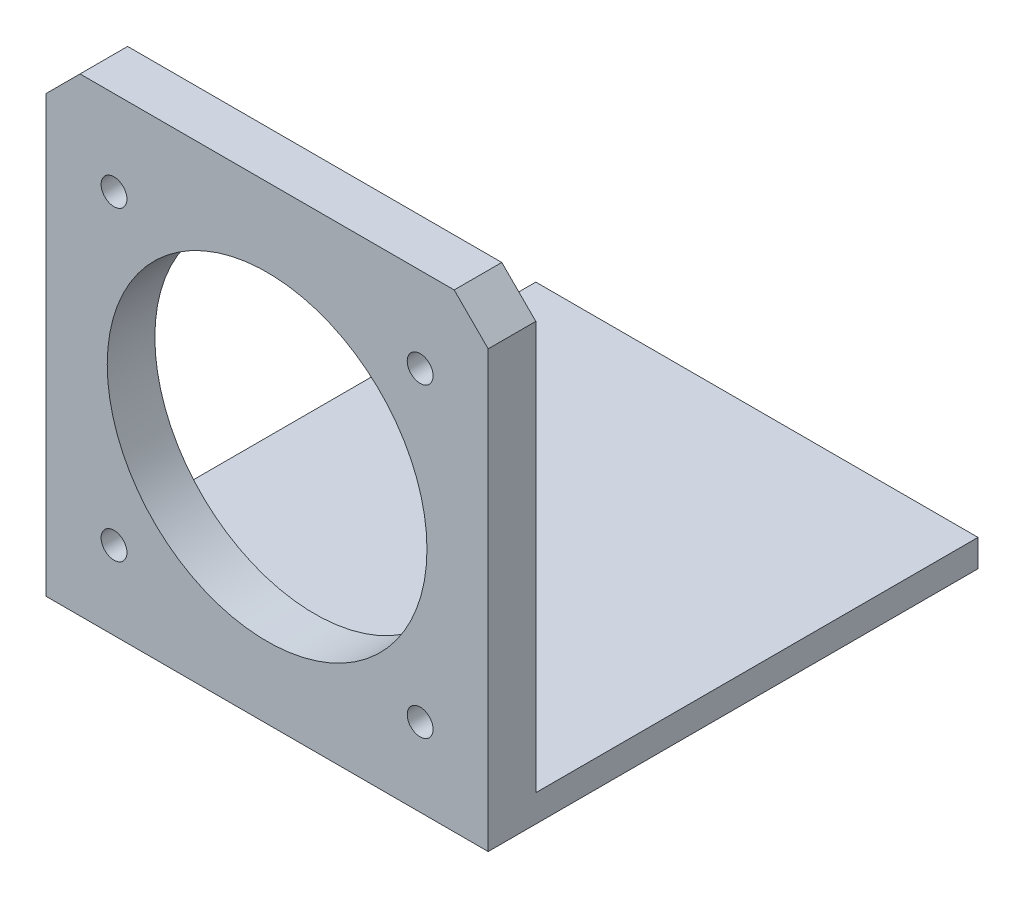
ISO-10303-21;
HEADER;
FILE_DESCRIPTION(('STEP AP214'),'2;1');
FILE_NAME('part.step','',(''),(''),'','','');
FILE_SCHEMA(('AUTOMOTIVE_DESIGN { 1 0 10303 214 1 1 1 1 }'));
ENDSEC;
DATA;
#1=APPLICATION_CONTEXT('core data for automotive mechanical design processes');
#2=APPLICATION_PROTOCOL_DEFINITION('international standard','automotive_design',2000,#1);
#3=PRODUCT_CONTEXT('',#1,'mechanical');
#4=PRODUCT('Part','Part','',(#3));
#5=PRODUCT_RELATED_PRODUCT_CATEGORY('part','',(#4));
#6=PRODUCT_DEFINITION_FORMATION('','',#4);
#7=PRODUCT_DEFINITION_CONTEXT('part definition',#1,'design');
#8=PRODUCT_DEFINITION('design','',#6,#7);
#9=PRODUCT_DEFINITION_SHAPE('','',#8);
#10=(LENGTH_UNIT() NAMED_UNIT(*) SI_UNIT(.MILLI.,.METRE.));
#11=(NAMED_UNIT(*) PLANE_ANGLE_UNIT() SI_UNIT($,.RADIAN.));
#12=(NAMED_UNIT(*) SI_UNIT($,.STERADIAN.) SOLID_ANGLE_UNIT());
#13=UNCERTAINTY_MEASURE_WITH_UNIT(LENGTH_MEASURE(1.E-05),#10,'distance_accuracy_value','');
#14=(GEOMETRIC_REPRESENTATION_CONTEXT(3) GLOBAL_UNCERTAINTY_ASSIGNED_CONTEXT((#13)) GLOBAL_UNIT_ASSIGNED_CONTEXT((#10,
#11,#12)) REPRESENTATION_CONTEXT('',''));
#15=CARTESIAN_POINT('',(0.,0.,0.));
#16=DIRECTION('',(0.,0.,1.));
#17=DIRECTION('',(1.,0.,0.));
#18=AXIS2_PLACEMENT_3D('',#15,#16,#17);
#19=CARTESIAN_POINT('',(65.,0.,0.));
#20=DIRECTION('',(0.,1.,0.));
#21=DIRECTION('',(0.,0.,1.));
#22=AXIS2_PLACEMENT_3D('',#19,#20,#21);
#23=PLANE('',#22);
#24=DIRECTION('',(0.,0.,-1.));
#25=VECTOR('',#24,1.);
#26=CARTESIAN_POINT('',(0.,0.,0.));
#27=LINE('',#26,#25);
#28=CARTESIAN_POINT('',(0.,0.,0.));
#29=VERTEX_POINT('',#28);
#30=CARTESIAN_POINT('',(0.,0.,-65.));
#31=VERTEX_POINT('',#30);
#32=EDGE_CURVE('E160',#29,#31,#27,.T.);
#33=ORIENTED_EDGE('',*,*,#32,.F.);
#34=DIRECTION('',(-1.,0.,0.));
#35=VECTOR('',#34,1.);
#36=CARTESIAN_POINT('',(65.,0.,0.));
#37=LINE('',#36,#35);
#38=CARTESIAN_POINT('',(65.,0.,0.));
#39=VERTEX_POINT('',#38);
#40=EDGE_CURVE('E140',#39,#29,#37,.T.);
#41=ORIENTED_EDGE('',*,*,#40,.F.);
#42=DIRECTION('',(0.,0.,-1.));
#43=VECTOR('',#42,1.);
#44=CARTESIAN_POINT('',(65.,0.,0.));
#45=LINE('',#44,#43);
#46=CARTESIAN_POINT('',(65.,0.,-65.));
#47=VERTEX_POINT('',#46);
#48=EDGE_CURVE('E133',#39,#47,#45,.T.);
#49=ORIENTED_EDGE('',*,*,#48,.T.);
#50=DIRECTION('',(-1.,0.,0.));
#51=VECTOR('',#50,1.);
#52=CARTESIAN_POINT('',(65.,0.,-65.));
#53=LINE('',#52,#51);
#54=EDGE_CURVE('E115',#47,#31,#53,.T.);
#55=ORIENTED_EDGE('',*,*,#54,.T.);
#56=EDGE_LOOP('',(#33,#41,#49,#55));
#57=FACE_BOUND('',#56,.T.);
#58=ADVANCED_FACE('F47',(#57),#23,.T.);
#59=CARTESIAN_POINT('',(65.,0.,0.));
#60=DIRECTION('',(0.,0.,1.));
#61=DIRECTION('',(1.,0.,0.));
#62=AXIS2_PLACEMENT_3D('',#59,#60,#61);
#63=PLANE('',#62);
#64=CARTESIAN_POINT('',(10.,7.50000000000001,0.));
#65=DIRECTION('',(0.,0.,1.));
#66=DIRECTION('',(1.,0.,0.));
#67=AXIS2_PLACEMENT_3D('',#64,#65,#66);
#68=CIRCLE('',#67,1.9);
#69=CARTESIAN_POINT('',(11.9,7.50000000000001,0.));
#70=VERTEX_POINT('',#69);
#71=EDGE_CURVE('E149',#70,#70,#68,.T.);
#72=ORIENTED_EDGE('',*,*,#71,.T.);
#73=EDGE_LOOP('',(#72));
#74=FACE_BOUND('',#73,.T.);
#75=CARTESIAN_POINT('',(55.,7.50000000000001,0.));
#76=DIRECTION('',(0.,0.,1.));
#77=DIRECTION('',(1.,0.,0.));
#78=AXIS2_PLACEMENT_3D('',#75,#76,#77);
#79=CIRCLE('',#78,1.9);
#80=CARTESIAN_POINT('',(56.9,7.50000000000001,0.));
#81=VERTEX_POINT('',#80);
#82=EDGE_CURVE('E342',#81,#81,#79,.T.);
#83=ORIENTED_EDGE('',*,*,#82,.T.);
#84=EDGE_LOOP('',(#83));
#85=FACE_BOUND('',#84,.T.);
#86=CARTESIAN_POINT('',(55.,52.5,0.));
#87=DIRECTION('',(0.,0.,1.));
#88=DIRECTION('',(1.,0.,0.));
#89=AXIS2_PLACEMENT_3D('',#86,#87,#88);
#90=CIRCLE('',#89,1.9);
#91=CARTESIAN_POINT('',(56.9,52.5,0.));
#92=VERTEX_POINT('',#91);
#93=EDGE_CURVE('E345',#92,#92,#90,.T.);
#94=ORIENTED_EDGE('',*,*,#93,.T.);
#95=EDGE_LOOP('',(#94));
#96=FACE_BOUND('',#95,.T.);
#97=CARTESIAN_POINT('',(10.,52.5,0.));
#98=DIRECTION('',(0.,0.,1.));
#99=DIRECTION('',(1.,0.,0.));
#100=AXIS2_PLACEMENT_3D('',#97,#98,#99);
#101=CIRCLE('',#100,1.9);
#102=CARTESIAN_POINT('',(11.9,52.5,0.));
#103=VERTEX_POINT('',#102);
#104=EDGE_CURVE('E350',#103,#103,#101,.T.);
#105=ORIENTED_EDGE('',*,*,#104,.T.);
#106=EDGE_LOOP('',(#105));
#107=FACE_BOUND('',#106,.T.);
#108=CARTESIAN_POINT('',(32.5,30.,0.));
#109=DIRECTION('',(0.,0.,1.));
#110=DIRECTION('',(1.,0.,0.));
#111=AXIS2_PLACEMENT_3D('',#108,#109,#110);
#112=CIRCLE('',#111,23.5);
#113=CARTESIAN_POINT('',(56.,30.,0.));
#114=VERTEX_POINT('',#113);
#115=EDGE_CURVE('E356',#114,#114,#112,.T.);
#116=ORIENTED_EDGE('',*,*,#115,.T.);
#117=EDGE_LOOP('',(#116));
#118=FACE_BOUND('',#117,.T.);
#119=DIRECTION('',(-1.,0.,0.));
#120=VECTOR('',#119,1.);
#121=CARTESIAN_POINT('',(65.,65.,0.));
#122=LINE('',#121,#120);
#123=CARTESIAN_POINT('',(60.,65.,0.));
#124=VERTEX_POINT('',#123);
#125=CARTESIAN_POINT('',(5.,65.,0.));
#126=VERTEX_POINT('',#125);
#127=EDGE_CURVE('E174',#124,#126,#122,.T.);
#128=ORIENTED_EDGE('',*,*,#127,.F.);
#129=DIRECTION('',(-0.707106781186548,0.707106781186547,0.));
#130=VECTOR('',#129,1.);
#131=CARTESIAN_POINT('',(65.,60.,0.));
#132=LINE('',#131,#130);
#133=CARTESIAN_POINT('',(65.,60.,0.));
#134=VERTEX_POINT('',#133);
#135=EDGE_CURVE('E57',#124,#134,#132,.F.);
#136=ORIENTED_EDGE('',*,*,#135,.T.);
#137=DIRECTION('',(0.,1.,0.));
#138=VECTOR('',#137,1.);
#139=CARTESIAN_POINT('',(65.,0.,0.));
#140=LINE('',#139,#138);
#141=EDGE_CURVE('E127',#39,#134,#140,.T.);
#142=ORIENTED_EDGE('',*,*,#141,.F.);
#143=ORIENTED_EDGE('',*,*,#40,.T.);
#144=DIRECTION('',(0.,1.,0.));
#145=VECTOR('',#144,1.);
#146=CARTESIAN_POINT('',(0.,0.,0.));
#147=LINE('',#146,#145);
#148=CARTESIAN_POINT('',(0.,60.,0.));
#149=VERTEX_POINT('',#148);
#150=EDGE_CURVE('E143',#29,#149,#147,.T.);
#151=ORIENTED_EDGE('',*,*,#150,.T.);
#152=DIRECTION('',(0.707106781186547,0.707106781186548,0.));
#153=VECTOR('',#152,1.);
#154=CARTESIAN_POINT('',(5.,65.,0.));
#155=LINE('',#154,#153);
#156=EDGE_CURVE('E69',#149,#126,#155,.T.);
#157=ORIENTED_EDGE('',*,*,#156,.T.);
#158=EDGE_LOOP('',(#128,#136,#142,#143,#151,#157));
#159=FACE_BOUND('',#158,.T.);
#160=ADVANCED_FACE('F205',(#74,#85,#96,#107,#118,#159),#63,.F.);
#161=CARTESIAN_POINT('',(65.,65.,0.));
#162=DIRECTION('',(0.,-1.,0.));
#163=DIRECTION('',(0.,0.,-1.));
#164=AXIS2_PLACEMENT_3D('',#161,#162,#163);
#165=PLANE('',#164);
#166=DIRECTION('',(-1.,0.,0.));
#167=VECTOR('',#166,1.);
#168=CARTESIAN_POINT('',(65.,65.,7.));
#169=LINE('',#168,#167);
#170=CARTESIAN_POINT('',(60.,65.,7.));
#171=VERTEX_POINT('',#170);
#172=CARTESIAN_POINT('',(5.,65.,7.));
#173=VERTEX_POINT('',#172);
#174=EDGE_CURVE('E177',#171,#173,#169,.T.);
#175=ORIENTED_EDGE('',*,*,#174,.F.);
#176=DIRECTION('',(0.,0.,-1.));
#177=VECTOR('',#176,1.);
#178=CARTESIAN_POINT('',(60.,65.,0.));
#179=LINE('',#178,#177);
#180=EDGE_CURVE('E199',#171,#124,#179,.T.);
#181=ORIENTED_EDGE('',*,*,#180,.T.);
#182=ORIENTED_EDGE('',*,*,#127,.T.);
#183=DIRECTION('',(0.,0.,1.));
#184=VECTOR('',#183,1.);
#185=CARTESIAN_POINT('',(5.,65.,7.));
#186=LINE('',#185,#184);
#187=EDGE_CURVE('E195',#126,#173,#186,.T.);
#188=ORIENTED_EDGE('',*,*,#187,.T.);
#189=EDGE_LOOP('',(#175,#181,#182,#188));
#190=FACE_BOUND('',#189,.T.);
#191=ADVANCED_FACE('F214',(#190),#165,.F.);
#192=CARTESIAN_POINT('',(65.,-4.,7.));
#193=DIRECTION('',(0.,0.,1.));
#194=DIRECTION('',(1.,0.,0.));
#195=AXIS2_PLACEMENT_3D('',#192,#193,#194);
#196=PLANE('',#195);
#197=CARTESIAN_POINT('',(10.,7.50000000000001,7.));
#198=DIRECTION('',(0.,0.,1.));
#199=DIRECTION('',(-1.,0.,0.));
#200=AXIS2_PLACEMENT_3D('',#197,#198,#199);
#201=CIRCLE('',#200,1.9);
#202=CARTESIAN_POINT('',(8.1,7.50000000000001,7.));
#203=VERTEX_POINT('',#202);
#204=EDGE_CURVE('E338',#203,#203,#201,.T.);
#205=ORIENTED_EDGE('',*,*,#204,.F.);
#206=EDGE_LOOP('',(#205));
#207=FACE_BOUND('',#206,.T.);
#208=CARTESIAN_POINT('',(55.,7.50000000000001,7.));
#209=DIRECTION('',(0.,0.,1.));
#210=DIRECTION('',(1.,0.,0.));
#211=AXIS2_PLACEMENT_3D('',#208,#209,#210);
#212=CIRCLE('',#211,1.9);
#213=CARTESIAN_POINT('',(56.9,7.50000000000001,7.));
#214=VERTEX_POINT('',#213);
#215=EDGE_CURVE('E367',#214,#214,#212,.T.);
#216=ORIENTED_EDGE('',*,*,#215,.F.);
#217=EDGE_LOOP('',(#216));
#218=FACE_BOUND('',#217,.T.);
#219=CARTESIAN_POINT('',(55.,52.5,7.));
#220=DIRECTION('',(0.,0.,1.));
#221=DIRECTION('',(-1.,0.,0.));
#222=AXIS2_PLACEMENT_3D('',#219,#220,#221);
#223=CIRCLE('',#222,1.9);
#224=CARTESIAN_POINT('',(53.1,52.5,7.));
#225=VERTEX_POINT('',#224);
#226=EDGE_CURVE('E371',#225,#225,#223,.T.);
#227=ORIENTED_EDGE('',*,*,#226,.F.);
#228=EDGE_LOOP('',(#227));
#229=FACE_BOUND('',#228,.T.);
#230=CARTESIAN_POINT('',(10.,52.5,7.));
#231=DIRECTION('',(0.,0.,1.));
#232=DIRECTION('',(1.,0.,0.));
#233=AXIS2_PLACEMENT_3D('',#230,#231,#232);
#234=CIRCLE('',#233,1.9);
#235=CARTESIAN_POINT('',(11.9,52.5,7.));
#236=VERTEX_POINT('',#235);
#237=EDGE_CURVE('E364',#236,#236,#234,.T.);
#238=ORIENTED_EDGE('',*,*,#237,.F.);
#239=EDGE_LOOP('',(#238));
#240=FACE_BOUND('',#239,.T.);
#241=CARTESIAN_POINT('',(32.5,30.,7.));
#242=DIRECTION('',(0.,0.,1.));
#243=DIRECTION('',(1.,0.,0.));
#244=AXIS2_PLACEMENT_3D('',#241,#242,#243);
#245=CIRCLE('',#244,23.5);
#246=CARTESIAN_POINT('',(56.,30.,7.));
#247=VERTEX_POINT('',#246);
#248=EDGE_CURVE('E360',#247,#247,#245,.T.);
#249=ORIENTED_EDGE('',*,*,#248,.F.);
#250=EDGE_LOOP('',(#249));
#251=FACE_BOUND('',#250,.T.);
#252=DIRECTION('',(0.,1.,0.));
#253=VECTOR('',#252,1.);
#254=CARTESIAN_POINT('',(65.,-4.,7.));
#255=LINE('',#254,#253);
#256=CARTESIAN_POINT('',(65.,-4.,7.));
#257=VERTEX_POINT('',#256);
#258=CARTESIAN_POINT('',(65.,60.,7.));
#259=VERTEX_POINT('',#258);
#260=EDGE_CURVE('E154',#257,#259,#255,.T.);
#261=ORIENTED_EDGE('',*,*,#260,.T.);
#262=DIRECTION('',(0.707106781186548,-0.707106781186547,0.));
#263=VECTOR('',#262,1.);
#264=CARTESIAN_POINT('',(97.,28.,7.));
#265=LINE('',#264,#263);
#266=EDGE_CURVE('E192',#259,#171,#265,.F.);
#267=ORIENTED_EDGE('',*,*,#266,.T.);
#268=ORIENTED_EDGE('',*,*,#174,.T.);
#269=DIRECTION('',(-0.707106781186547,-0.707106781186548,0.));
#270=VECTOR('',#269,1.);
#271=CARTESIAN_POINT('',(0.499999999999959,60.4999999999999,7.));
#272=LINE('',#271,#270);
#273=CARTESIAN_POINT('',(0.,60.,7.));
#274=VERTEX_POINT('',#273);
#275=EDGE_CURVE('E189',#173,#274,#272,.T.);
#276=ORIENTED_EDGE('',*,*,#275,.T.);
#277=DIRECTION('',(0.,1.,0.));
#278=VECTOR('',#277,1.);
#279=CARTESIAN_POINT('',(0.,-4.,7.));
#280=LINE('',#279,#278);
#281=CARTESIAN_POINT('',(0.,-4.,7.));
#282=VERTEX_POINT('',#281);
#283=EDGE_CURVE('E146',#282,#274,#280,.T.);
#284=ORIENTED_EDGE('',*,*,#283,.F.);
#285=DIRECTION('',(-1.,0.,0.));
#286=VECTOR('',#285,1.);
#287=CARTESIAN_POINT('',(65.,-4.,7.));
#288=LINE('',#287,#286);
#289=EDGE_CURVE('E181',#257,#282,#288,.T.);
#290=ORIENTED_EDGE('',*,*,#289,.F.);
#291=EDGE_LOOP('',(#261,#267,#268,#276,#284,#290));
#292=FACE_BOUND('',#291,.T.);
#293=ADVANCED_FACE('F212',(#207,#218,#229,#240,#251,#292),#196,.T.);
#294=CARTESIAN_POINT('',(65.,-4.,7.));
#295=DIRECTION('',(0.,1.,0.));
#296=DIRECTION('',(0.,0.,1.));
#297=AXIS2_PLACEMENT_3D('',#294,#295,#296);
#298=PLANE('',#297);
#299=DIRECTION('',(0.,0.,-1.));
#300=VECTOR('',#299,1.);
#301=CARTESIAN_POINT('',(0.,-4.,7.));
#302=LINE('',#301,#300);
#303=CARTESIAN_POINT('',(0.,-4.,-65.));
#304=VERTEX_POINT('',#303);
#305=EDGE_CURVE('E165',#282,#304,#302,.T.);
#306=ORIENTED_EDGE('',*,*,#305,.T.);
#307=DIRECTION('',(-1.,0.,0.));
#308=VECTOR('',#307,1.);
#309=CARTESIAN_POINT('',(65.,-4.,-65.));
#310=LINE('',#309,#308);
#311=CARTESIAN_POINT('',(65.,-4.,-65.));
#312=VERTEX_POINT('',#311);
#313=EDGE_CURVE('E126',#312,#304,#310,.T.);
#314=ORIENTED_EDGE('',*,*,#313,.F.);
#315=DIRECTION('',(0.,0.,-1.));
#316=VECTOR('',#315,1.);
#317=CARTESIAN_POINT('',(65.,-4.,7.));
#318=LINE('',#317,#316);
#319=EDGE_CURVE('E136',#257,#312,#318,.T.);
#320=ORIENTED_EDGE('',*,*,#319,.F.);
#321=ORIENTED_EDGE('',*,*,#289,.T.);
#322=EDGE_LOOP('',(#306,#314,#320,#321));
#323=FACE_BOUND('',#322,.T.);
#324=ADVANCED_FACE('F221',(#323),#298,.F.);
#325=CARTESIAN_POINT('',(65.,0.,-65.));
#326=DIRECTION('',(0.,0.,-1.));
#327=DIRECTION('',(-1.,0.,0.));
#328=AXIS2_PLACEMENT_3D('',#325,#326,#327);
#329=PLANE('',#328);
#330=DIRECTION('',(0.,-1.,0.));
#331=VECTOR('',#330,1.);
#332=CARTESIAN_POINT('',(0.,0.,-65.));
#333=LINE('',#332,#331);
#334=EDGE_CURVE('E120',#31,#304,#333,.T.);
#335=ORIENTED_EDGE('',*,*,#334,.F.);
#336=ORIENTED_EDGE('',*,*,#54,.F.);
#337=DIRECTION('',(0.,-1.,0.));
#338=VECTOR('',#337,1.);
#339=CARTESIAN_POINT('',(65.,0.,-65.));
#340=LINE('',#339,#338);
#341=EDGE_CURVE('E118',#47,#312,#340,.T.);
#342=ORIENTED_EDGE('',*,*,#341,.T.);
#343=ORIENTED_EDGE('',*,*,#313,.T.);
#344=EDGE_LOOP('',(#335,#336,#342,#343));
#345=FACE_BOUND('',#344,.T.);
#346=ADVANCED_FACE('F117',(#345),#329,.T.);
#347=CARTESIAN_POINT('',(65.,0.,0.));
#348=DIRECTION('',(-1.,0.,0.));
#349=DIRECTION('',(0.,0.,1.));
#350=AXIS2_PLACEMENT_3D('',#347,#348,#349);
#351=PLANE('',#350);
#352=ORIENTED_EDGE('',*,*,#141,.T.);
#353=DIRECTION('',(0.,0.,1.));
#354=VECTOR('',#353,1.);
#355=CARTESIAN_POINT('',(65.,60.,0.));
#356=LINE('',#355,#354);
#357=EDGE_CURVE('E173',#134,#259,#356,.T.);
#358=ORIENTED_EDGE('',*,*,#357,.T.);
#359=ORIENTED_EDGE('',*,*,#260,.F.);
#360=ORIENTED_EDGE('',*,*,#319,.T.);
#361=ORIENTED_EDGE('',*,*,#341,.F.);
#362=ORIENTED_EDGE('',*,*,#48,.F.);
#363=EDGE_LOOP('',(#352,#358,#359,#360,#361,#362));
#364=FACE_BOUND('',#363,.T.);
#365=ADVANCED_FACE('F132',(#364),#351,.F.);
#366=CARTESIAN_POINT('',(0.,0.,0.));
#367=DIRECTION('',(-1.,0.,0.));
#368=DIRECTION('',(0.,0.,1.));
#369=AXIS2_PLACEMENT_3D('',#366,#367,#368);
#370=PLANE('',#369);
#371=ORIENTED_EDGE('',*,*,#283,.T.);
#372=DIRECTION('',(0.,0.,-1.));
#373=VECTOR('',#372,1.);
#374=CARTESIAN_POINT('',(0.,60.,0.));
#375=LINE('',#374,#373);
#376=EDGE_CURVE('E11',#274,#149,#375,.T.);
#377=ORIENTED_EDGE('',*,*,#376,.T.);
#378=ORIENTED_EDGE('',*,*,#150,.F.);
#379=ORIENTED_EDGE('',*,*,#32,.T.);
#380=ORIENTED_EDGE('',*,*,#334,.T.);
#381=ORIENTED_EDGE('',*,*,#305,.F.);
#382=EDGE_LOOP('',(#371,#377,#378,#379,#380,#381));
#383=FACE_BOUND('',#382,.T.);
#384=ADVANCED_FACE('F219',(#383),#370,.T.);
#385=CARTESIAN_POINT('',(65.,60.,0.));
#386=DIRECTION('',(-0.707106781186547,-0.707106781186548,0.));
#387=DIRECTION('',(0.,0.,1.));
#388=AXIS2_PLACEMENT_3D('',#385,#386,#387);
#389=PLANE('',#388);
#390=ORIENTED_EDGE('',*,*,#135,.F.);
#391=ORIENTED_EDGE('',*,*,#180,.F.);
#392=ORIENTED_EDGE('',*,*,#266,.F.);
#393=ORIENTED_EDGE('',*,*,#357,.F.);
#394=EDGE_LOOP('',(#390,#391,#392,#393));
#395=FACE_BOUND('',#394,.T.);
#396=ADVANCED_FACE('F209',(#395),#389,.F.);
#397=CARTESIAN_POINT('',(5.,65.,0.));
#398=DIRECTION('',(-0.707106781186548,0.707106781186547,0.));
#399=DIRECTION('',(0.,0.,-1.));
#400=AXIS2_PLACEMENT_3D('',#397,#398,#399);
#401=PLANE('',#400);
#402=ORIENTED_EDGE('',*,*,#156,.F.);
#403=ORIENTED_EDGE('',*,*,#376,.F.);
#404=ORIENTED_EDGE('',*,*,#275,.F.);
#405=ORIENTED_EDGE('',*,*,#187,.F.);
#406=EDGE_LOOP('',(#402,#403,#404,#405));
#407=FACE_BOUND('',#406,.T.);
#408=ADVANCED_FACE('F50',(#407),#401,.T.);
#409=CARTESIAN_POINT('',(32.5,30.,-58.));
#410=DIRECTION('',(0.,0.,1.));
#411=DIRECTION('',(1.,0.,0.));
#412=AXIS2_PLACEMENT_3D('',#409,#410,#411);
#413=CYLINDRICAL_SURFACE('',#412,23.5);
#414=ORIENTED_EDGE('',*,*,#248,.T.);
#415=EDGE_LOOP('',(#414));
#416=FACE_BOUND('',#415,.T.);
#417=ORIENTED_EDGE('',*,*,#115,.F.);
#418=EDGE_LOOP('',(#417));
#419=FACE_BOUND('',#418,.T.);
#420=ADVANCED_FACE('F246',(#416,#419),#413,.F.);
#421=CARTESIAN_POINT('',(10.,52.5,-58.));
#422=DIRECTION('',(0.,0.,1.));
#423=DIRECTION('',(1.,0.,0.));
#424=AXIS2_PLACEMENT_3D('',#421,#422,#423);
#425=CYLINDRICAL_SURFACE('',#424,1.9);
#426=ORIENTED_EDGE('',*,*,#237,.T.);
#427=EDGE_LOOP('',(#426));
#428=FACE_BOUND('',#427,.T.);
#429=ORIENTED_EDGE('',*,*,#104,.F.);
#430=EDGE_LOOP('',(#429));
#431=FACE_BOUND('',#430,.T.);
#432=ADVANCED_FACE('F293',(#428,#431),#425,.F.);
#433=CARTESIAN_POINT('',(55.,52.5,-58.));
#434=DIRECTION('',(0.,0.,1.));
#435=DIRECTION('',(1.,0.,0.));
#436=AXIS2_PLACEMENT_3D('',#433,#434,#435);
#437=CYLINDRICAL_SURFACE('',#436,1.9);
#438=ORIENTED_EDGE('',*,*,#226,.T.);
#439=EDGE_LOOP('',(#438));
#440=FACE_BOUND('',#439,.T.);
#441=ORIENTED_EDGE('',*,*,#93,.F.);
#442=EDGE_LOOP('',(#441));
#443=FACE_BOUND('',#442,.T.);
#444=ADVANCED_FACE('F302',(#440,#443),#437,.F.);
#445=CARTESIAN_POINT('',(55.,7.50000000000001,-58.));
#446=DIRECTION('',(0.,0.,1.));
#447=DIRECTION('',(1.,0.,0.));
#448=AXIS2_PLACEMENT_3D('',#445,#446,#447);
#449=CYLINDRICAL_SURFACE('',#448,1.9);
#450=ORIENTED_EDGE('',*,*,#215,.T.);
#451=EDGE_LOOP('',(#450));
#452=FACE_BOUND('',#451,.T.);
#453=ORIENTED_EDGE('',*,*,#82,.F.);
#454=EDGE_LOOP('',(#453));
#455=FACE_BOUND('',#454,.T.);
#456=ADVANCED_FACE('F312',(#452,#455),#449,.F.);
#457=CARTESIAN_POINT('',(10.,7.50000000000001,-58.));
#458=DIRECTION('',(0.,0.,1.));
#459=DIRECTION('',(1.,0.,0.));
#460=AXIS2_PLACEMENT_3D('',#457,#458,#459);
#461=CYLINDRICAL_SURFACE('',#460,1.9);
#462=ORIENTED_EDGE('',*,*,#204,.T.);
#463=EDGE_LOOP('',(#462));
#464=FACE_BOUND('',#463,.T.);
#465=ORIENTED_EDGE('',*,*,#71,.F.);
#466=EDGE_LOOP('',(#465));
#467=FACE_BOUND('',#466,.T.);
#468=ADVANCED_FACE('F322',(#464,#467),#461,.F.);
#469=CLOSED_SHELL('',(#58,#160,#191,#293,#324,#346,#365,#384,#396,#408,#420,#432,#444,#456,#468));
#470=MANIFOLD_SOLID_BREP('B2',#469);
#471=ADVANCED_BREP_SHAPE_REPRESENTATION('',(#18,#470),#14);
#472=SHAPE_DEFINITION_REPRESENTATION(#9,#471);
ENDSEC;
END-ISO-10303-21;
